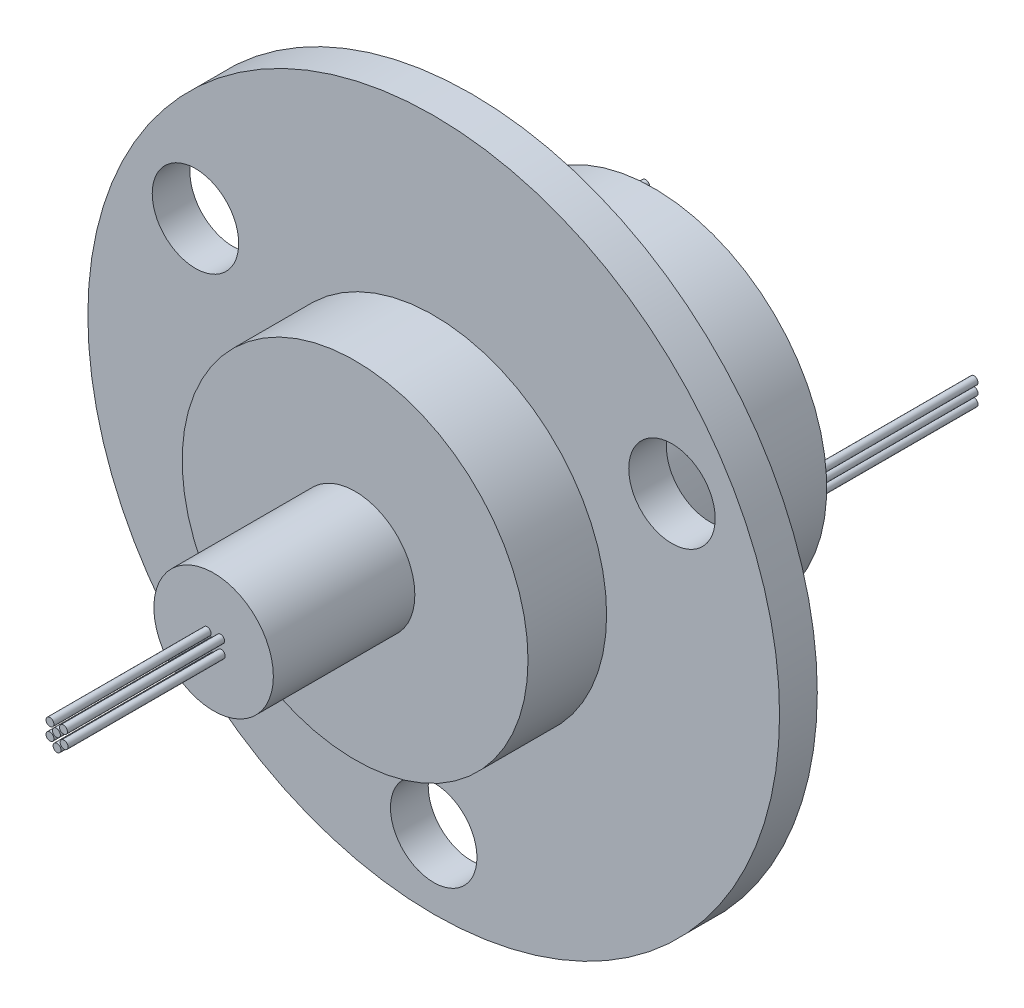
ISO-10303-21;
HEADER;
FILE_DESCRIPTION(('STEP AP214'),'2;1');
FILE_NAME('part.step','',(''),(''),'','','');
FILE_SCHEMA(('AUTOMOTIVE_DESIGN { 1 0 10303 214 1 1 1 1 }'));
ENDSEC;
DATA;
#1=APPLICATION_CONTEXT('core data for automotive mechanical design processes');
#2=APPLICATION_PROTOCOL_DEFINITION('international standard','automotive_design',2000,#1);
#3=PRODUCT_CONTEXT('',#1,'mechanical');
#4=PRODUCT('Part','Part','',(#3));
#5=PRODUCT_RELATED_PRODUCT_CATEGORY('part','',(#4));
#6=PRODUCT_DEFINITION_FORMATION('','',#4);
#7=PRODUCT_DEFINITION_CONTEXT('part definition',#1,'design');
#8=PRODUCT_DEFINITION('design','',#6,#7);
#9=PRODUCT_DEFINITION_SHAPE('','',#8);
#10=(LENGTH_UNIT() NAMED_UNIT(*) SI_UNIT(.MILLI.,.METRE.));
#11=(NAMED_UNIT(*) PLANE_ANGLE_UNIT() SI_UNIT($,.RADIAN.));
#12=(NAMED_UNIT(*) SI_UNIT($,.STERADIAN.) SOLID_ANGLE_UNIT());
#13=UNCERTAINTY_MEASURE_WITH_UNIT(LENGTH_MEASURE(1.E-05),#10,'distance_accuracy_value','');
#14=(GEOMETRIC_REPRESENTATION_CONTEXT(3) GLOBAL_UNCERTAINTY_ASSIGNED_CONTEXT((#13)) GLOBAL_UNIT_ASSIGNED_CONTEXT((#10,
#11,#12)) REPRESENTATION_CONTEXT('',''));
#15=CARTESIAN_POINT('',(0.,0.,0.));
#16=DIRECTION('',(0.,0.,1.));
#17=DIRECTION('',(1.,0.,0.));
#18=AXIS2_PLACEMENT_3D('',#15,#16,#17);
#19=CARTESIAN_POINT('',(0.,0.,0.));
#20=DIRECTION('',(0.,0.,-1.));
#21=DIRECTION('',(-1.,0.,0.));
#22=AXIS2_PLACEMENT_3D('',#19,#20,#21);
#23=PLANE('',#22);
#24=CARTESIAN_POINT('',(15.1554445662278,8.74999999999986,0.));
#25=DIRECTION('',(0.,0.,-1.));
#26=DIRECTION('',(-1.,0.,0.));
#27=AXIS2_PLACEMENT_3D('',#24,#25,#26);
#28=CIRCLE('',#27,2.74999999999998);
#29=CARTESIAN_POINT('',(12.4054445662278,8.74999999999986,0.));
#30=VERTEX_POINT('',#29);
#31=EDGE_CURVE('E66',#30,#30,#28,.T.);
#32=ORIENTED_EDGE('',*,*,#31,.F.);
#33=EDGE_LOOP('',(#32));
#34=FACE_BOUND('',#33,.T.);
#35=CARTESIAN_POINT('',(-15.1554445662276,8.75000000000007,0.));
#36=DIRECTION('',(0.,0.,-1.));
#37=DIRECTION('',(-1.,0.,0.));
#38=AXIS2_PLACEMENT_3D('',#35,#36,#37);
#39=CIRCLE('',#38,2.74999999999998);
#40=CARTESIAN_POINT('',(-17.9054445662276,8.75000000000007,0.));
#41=VERTEX_POINT('',#40);
#42=EDGE_CURVE('E56',#41,#41,#39,.T.);
#43=ORIENTED_EDGE('',*,*,#42,.F.);
#44=EDGE_LOOP('',(#43));
#45=FACE_BOUND('',#44,.T.);
#46=CARTESIAN_POINT('',(0.,-17.5,0.));
#47=DIRECTION('',(0.,0.,-1.));
#48=DIRECTION('',(-1.,0.,0.));
#49=AXIS2_PLACEMENT_3D('',#46,#47,#48);
#50=CIRCLE('',#49,2.74999999999998);
#51=CARTESIAN_POINT('',(-2.74999999999998,-17.5,0.));
#52=VERTEX_POINT('',#51);
#53=EDGE_CURVE('E53',#52,#52,#50,.T.);
#54=ORIENTED_EDGE('',*,*,#53,.F.);
#55=EDGE_LOOP('',(#54));
#56=FACE_BOUND('',#55,.T.);
#57=CARTESIAN_POINT('',(0.,0.,0.));
#58=DIRECTION('',(0.,0.,-1.));
#59=DIRECTION('',(-1.,0.,0.));
#60=AXIS2_PLACEMENT_3D('',#57,#58,#59);
#61=CIRCLE('',#60,22.);
#62=CARTESIAN_POINT('',(-22.,0.,0.));
#63=VERTEX_POINT('',#62);
#64=EDGE_CURVE('E123',#63,#63,#61,.T.);
#65=ORIENTED_EDGE('',*,*,#64,.T.);
#66=EDGE_LOOP('',(#65));
#67=FACE_BOUND('',#66,.T.);
#68=CARTESIAN_POINT('',(0.,0.,0.));
#69=DIRECTION('',(0.,0.,-1.));
#70=DIRECTION('',(-1.,0.,0.));
#71=AXIS2_PLACEMENT_3D('',#68,#69,#70);
#72=CIRCLE('',#71,11.);
#73=CARTESIAN_POINT('',(-11.,0.,0.));
#74=VERTEX_POINT('',#73);
#75=EDGE_CURVE('E101',#74,#74,#72,.T.);
#76=ORIENTED_EDGE('',*,*,#75,.F.);
#77=EDGE_LOOP('',(#76));
#78=FACE_BOUND('',#77,.T.);
#79=ADVANCED_FACE('F33',(#34,#45,#56,#67,#78),#23,.T.);
#80=CARTESIAN_POINT('',(0.,0.,16.4));
#81=DIRECTION('',(0.,0.,1.));
#82=DIRECTION('',(1.,0.,0.));
#83=AXIS2_PLACEMENT_3D('',#80,#81,#82);
#84=PLANE('',#83);
#85=CARTESIAN_POINT('',(-0.411746994245732,-0.416347148972295,16.4));
#86=DIRECTION('',(0.,0.,1.));
#87=DIRECTION('',(1.,0.,0.));
#88=AXIS2_PLACEMENT_3D('',#85,#86,#87);
#89=CIRCLE('',#88,0.25);
#90=CARTESIAN_POINT('',(-0.161746994245732,-0.416347148972295,16.4));
#91=VERTEX_POINT('',#90);
#92=EDGE_CURVE('E10',#91,#91,#89,.T.);
#93=ORIENTED_EDGE('',*,*,#92,.F.);
#94=EDGE_LOOP('',(#93));
#95=FACE_BOUND('',#94,.T.);
#96=CARTESIAN_POINT('',(0.447352368894371,0.400094571758075,16.4));
#97=DIRECTION('',(0.,0.,1.));
#98=DIRECTION('',(1.,0.,0.));
#99=AXIS2_PLACEMENT_3D('',#96,#97,#98);
#100=CIRCLE('',#99,0.25);
#101=CARTESIAN_POINT('',(0.697352368894371,0.400094571758075,16.4));
#102=VERTEX_POINT('',#101);
#103=EDGE_CURVE('E140',#102,#102,#100,.T.);
#104=ORIENTED_EDGE('',*,*,#103,.F.);
#105=EDGE_LOOP('',(#104));
#106=FACE_BOUND('',#105,.T.);
#107=CARTESIAN_POINT('',(-0.411746994245732,0.383652851027705,16.4));
#108=DIRECTION('',(0.,0.,1.));
#109=DIRECTION('',(1.,0.,0.));
#110=AXIS2_PLACEMENT_3D('',#107,#108,#109);
#111=CIRCLE('',#110,0.25);
#112=CARTESIAN_POINT('',(-0.161746994245732,0.383652851027705,16.4));
#113=VERTEX_POINT('',#112);
#114=EDGE_CURVE('E137',#113,#113,#111,.T.);
#115=ORIENTED_EDGE('',*,*,#114,.F.);
#116=EDGE_LOOP('',(#115));
#117=FACE_BOUND('',#116,.T.);
#118=CARTESIAN_POINT('',(0.488253005754268,-0.416347148972295,16.4));
#119=DIRECTION('',(0.,0.,1.));
#120=DIRECTION('',(1.,0.,0.));
#121=AXIS2_PLACEMENT_3D('',#118,#119,#120);
#122=CIRCLE('',#121,0.25);
#123=CARTESIAN_POINT('',(0.738253005754268,-0.416347148972295,16.4));
#124=VERTEX_POINT('',#123);
#125=EDGE_CURVE('E134',#124,#124,#122,.T.);
#126=ORIENTED_EDGE('',*,*,#125,.F.);
#127=EDGE_LOOP('',(#126));
#128=FACE_BOUND('',#127,.T.);
#129=CARTESIAN_POINT('',(0.0382530057542681,-0.816347148972295,16.4));
#130=DIRECTION('',(0.,0.,1.));
#131=DIRECTION('',(1.,0.,0.));
#132=AXIS2_PLACEMENT_3D('',#129,#130,#131);
#133=CIRCLE('',#132,0.25);
#134=CARTESIAN_POINT('',(0.288253005754268,-0.816347148972295,16.4));
#135=VERTEX_POINT('',#134);
#136=EDGE_CURVE('E131',#135,#135,#133,.T.);
#137=ORIENTED_EDGE('',*,*,#136,.F.);
#138=EDGE_LOOP('',(#137));
#139=FACE_BOUND('',#138,.T.);
#140=CARTESIAN_POINT('',(0.,0.,16.4));
#141=DIRECTION('',(0.,0.,1.));
#142=DIRECTION('',(1.,0.,0.));
#143=AXIS2_PLACEMENT_3D('',#140,#141,#142);
#144=CIRCLE('',#143,3.8);
#145=CARTESIAN_POINT('',(3.8,0.,16.4));
#146=VERTEX_POINT('',#145);
#147=EDGE_CURVE('E114',#146,#146,#144,.T.);
#148=ORIENTED_EDGE('',*,*,#147,.T.);
#149=EDGE_LOOP('',(#148));
#150=FACE_BOUND('',#149,.T.);
#151=CARTESIAN_POINT('',(0.,0.,16.4));
#152=DIRECTION('',(0.,0.,1.));
#153=DIRECTION('',(1.,0.,0.));
#154=AXIS2_PLACEMENT_3D('',#151,#152,#153);
#155=CIRCLE('',#154,0.25);
#156=CARTESIAN_POINT('',(0.25,0.,16.4));
#157=VERTEX_POINT('',#156);
#158=EDGE_CURVE('E105',#157,#157,#155,.T.);
#159=ORIENTED_EDGE('',*,*,#158,.F.);
#160=EDGE_LOOP('',(#159));
#161=FACE_BOUND('',#160,.T.);
#162=ADVANCED_FACE('F183',(#95,#106,#117,#128,#139,#150,#161),#84,.T.);
#163=CARTESIAN_POINT('',(0.,0.,7.4));
#164=DIRECTION('',(0.,0.,1.));
#165=DIRECTION('',(1.,0.,0.));
#166=AXIS2_PLACEMENT_3D('',#163,#164,#165);
#167=PLANE('',#166);
#168=CARTESIAN_POINT('',(0.,0.,7.4));
#169=DIRECTION('',(0.,0.,1.));
#170=DIRECTION('',(1.,0.,0.));
#171=AXIS2_PLACEMENT_3D('',#168,#169,#170);
#172=CIRCLE('',#171,11.);
#173=CARTESIAN_POINT('',(11.,0.,7.4));
#174=VERTEX_POINT('',#173);
#175=EDGE_CURVE('E120',#174,#174,#172,.T.);
#176=ORIENTED_EDGE('',*,*,#175,.T.);
#177=EDGE_LOOP('',(#176));
#178=FACE_BOUND('',#177,.T.);
#179=CARTESIAN_POINT('',(0.,0.,7.4));
#180=DIRECTION('',(0.,0.,1.));
#181=DIRECTION('',(1.,0.,0.));
#182=AXIS2_PLACEMENT_3D('',#179,#180,#181);
#183=CIRCLE('',#182,3.8);
#184=CARTESIAN_POINT('',(3.8,0.,7.4));
#185=VERTEX_POINT('',#184);
#186=EDGE_CURVE('E111',#185,#185,#183,.T.);
#187=ORIENTED_EDGE('',*,*,#186,.F.);
#188=EDGE_LOOP('',(#187));
#189=FACE_BOUND('',#188,.T.);
#190=ADVANCED_FACE('F189',(#178,#189),#167,.T.);
#191=CARTESIAN_POINT('',(22.,0.,2.4));
#192=DIRECTION('',(0.,0.,1.));
#193=DIRECTION('',(1.,0.,0.));
#194=AXIS2_PLACEMENT_3D('',#191,#192,#193);
#195=PLANE('',#194);
#196=CARTESIAN_POINT('',(15.1554445662278,8.74999999999986,2.4));
#197=DIRECTION('',(0.,0.,1.));
#198=DIRECTION('',(1.,0.,0.));
#199=AXIS2_PLACEMENT_3D('',#196,#197,#198);
#200=CIRCLE('',#199,2.74999999999998);
#201=CARTESIAN_POINT('',(17.9054445662277,8.74999999999986,2.4));
#202=VERTEX_POINT('',#201);
#203=EDGE_CURVE('E37',#202,#202,#200,.T.);
#204=ORIENTED_EDGE('',*,*,#203,.F.);
#205=EDGE_LOOP('',(#204));
#206=FACE_BOUND('',#205,.T.);
#207=CARTESIAN_POINT('',(-15.1554445662276,8.75000000000007,2.4));
#208=DIRECTION('',(0.,0.,1.));
#209=DIRECTION('',(1.,0.,0.));
#210=AXIS2_PLACEMENT_3D('',#207,#208,#209);
#211=CIRCLE('',#210,2.74999999999998);
#212=CARTESIAN_POINT('',(-12.4054445662277,8.75000000000007,2.4));
#213=VERTEX_POINT('',#212);
#214=EDGE_CURVE('E54',#213,#213,#211,.T.);
#215=ORIENTED_EDGE('',*,*,#214,.F.);
#216=EDGE_LOOP('',(#215));
#217=FACE_BOUND('',#216,.T.);
#218=CARTESIAN_POINT('',(0.,-17.5,2.4));
#219=DIRECTION('',(0.,0.,1.));
#220=DIRECTION('',(1.,0.,0.));
#221=AXIS2_PLACEMENT_3D('',#218,#219,#220);
#222=CIRCLE('',#221,2.74999999999998);
#223=CARTESIAN_POINT('',(2.74999999999998,-17.5,2.4));
#224=VERTEX_POINT('',#223);
#225=EDGE_CURVE('E50',#224,#224,#222,.T.);
#226=ORIENTED_EDGE('',*,*,#225,.F.);
#227=EDGE_LOOP('',(#226));
#228=FACE_BOUND('',#227,.T.);
#229=CARTESIAN_POINT('',(0.,0.,2.4));
#230=DIRECTION('',(0.,0.,-1.));
#231=DIRECTION('',(-1.,0.,0.));
#232=AXIS2_PLACEMENT_3D('',#229,#230,#231);
#233=CIRCLE('',#232,22.);
#234=CARTESIAN_POINT('',(-22.,0.,2.4));
#235=VERTEX_POINT('',#234);
#236=EDGE_CURVE('E128',#235,#235,#233,.T.);
#237=ORIENTED_EDGE('',*,*,#236,.F.);
#238=EDGE_LOOP('',(#237));
#239=FACE_BOUND('',#238,.T.);
#240=CARTESIAN_POINT('',(0.,0.,2.4));
#241=DIRECTION('',(0.,0.,1.));
#242=DIRECTION('',(1.,0.,0.));
#243=AXIS2_PLACEMENT_3D('',#240,#241,#242);
#244=CIRCLE('',#243,11.);
#245=CARTESIAN_POINT('',(11.,0.,2.4));
#246=VERTEX_POINT('',#245);
#247=EDGE_CURVE('E117',#246,#246,#244,.T.);
#248=ORIENTED_EDGE('',*,*,#247,.F.);
#249=EDGE_LOOP('',(#248));
#250=FACE_BOUND('',#249,.T.);
#251=ADVANCED_FACE('F197',(#206,#217,#228,#239,#250),#195,.T.);
#252=CARTESIAN_POINT('',(0.,0.,2.4));
#253=DIRECTION('',(0.,0.,-1.));
#254=DIRECTION('',(-1.,0.,0.));
#255=AXIS2_PLACEMENT_3D('',#252,#253,#254);
#256=CYLINDRICAL_SURFACE('',#255,22.);
#257=ORIENTED_EDGE('',*,*,#236,.T.);
#258=EDGE_LOOP('',(#257));
#259=FACE_BOUND('',#258,.T.);
#260=ORIENTED_EDGE('',*,*,#64,.F.);
#261=EDGE_LOOP('',(#260));
#262=FACE_BOUND('',#261,.T.);
#263=ADVANCED_FACE('F35',(#259,#262),#256,.T.);
#264=CARTESIAN_POINT('',(0.,0.,7.4));
#265=DIRECTION('',(0.,0.,-1.));
#266=DIRECTION('',(-1.,0.,0.));
#267=AXIS2_PLACEMENT_3D('',#264,#265,#266);
#268=CYLINDRICAL_SURFACE('',#267,11.);
#269=ORIENTED_EDGE('',*,*,#175,.F.);
#270=EDGE_LOOP('',(#269));
#271=FACE_BOUND('',#270,.T.);
#272=ORIENTED_EDGE('',*,*,#247,.T.);
#273=EDGE_LOOP('',(#272));
#274=FACE_BOUND('',#273,.T.);
#275=ADVANCED_FACE('F195',(#271,#274),#268,.T.);
#276=CARTESIAN_POINT('',(0.,0.,16.4));
#277=DIRECTION('',(0.,0.,-1.));
#278=DIRECTION('',(-1.,0.,0.));
#279=AXIS2_PLACEMENT_3D('',#276,#277,#278);
#280=CYLINDRICAL_SURFACE('',#279,3.8);
#281=ORIENTED_EDGE('',*,*,#147,.F.);
#282=EDGE_LOOP('',(#281));
#283=FACE_BOUND('',#282,.T.);
#284=ORIENTED_EDGE('',*,*,#186,.T.);
#285=EDGE_LOOP('',(#284));
#286=FACE_BOUND('',#285,.T.);
#287=ADVANCED_FACE('F216',(#283,#286),#280,.T.);
#288=CARTESIAN_POINT('',(0.,0.,26.4));
#289=DIRECTION('',(0.,0.,-1.));
#290=DIRECTION('',(-1.,0.,0.));
#291=AXIS2_PLACEMENT_3D('',#288,#289,#290);
#292=CYLINDRICAL_SURFACE('',#291,0.25);
#293=CARTESIAN_POINT('',(0.,0.,26.4));
#294=DIRECTION('',(0.,0.,1.));
#295=DIRECTION('',(1.,0.,0.));
#296=AXIS2_PLACEMENT_3D('',#293,#294,#295);
#297=CIRCLE('',#296,0.25);
#298=CARTESIAN_POINT('',(0.25,0.,26.4));
#299=VERTEX_POINT('',#298);
#300=EDGE_CURVE('E108',#299,#299,#297,.T.);
#301=ORIENTED_EDGE('',*,*,#300,.F.);
#302=EDGE_LOOP('',(#301));
#303=FACE_BOUND('',#302,.T.);
#304=ORIENTED_EDGE('',*,*,#158,.T.);
#305=EDGE_LOOP('',(#304));
#306=FACE_BOUND('',#305,.T.);
#307=ADVANCED_FACE('F221',(#303,#306),#292,.T.);
#308=CARTESIAN_POINT('',(0.,0.,26.4));
#309=DIRECTION('',(0.,0.,1.));
#310=DIRECTION('',(1.,0.,0.));
#311=AXIS2_PLACEMENT_3D('',#308,#309,#310);
#312=PLANE('',#311);
#313=ORIENTED_EDGE('',*,*,#300,.T.);
#314=EDGE_LOOP('',(#313));
#315=FACE_BOUND('',#314,.T.);
#316=ADVANCED_FACE('F178',(#315),#312,.T.);
#317=CARTESIAN_POINT('',(0.,0.,-11.6));
#318=DIRECTION('',(0.,0.,1.));
#319=DIRECTION('',(1.,0.,0.));
#320=AXIS2_PLACEMENT_3D('',#317,#318,#319);
#321=CYLINDRICAL_SURFACE('',#320,11.);
#322=CARTESIAN_POINT('',(0.,0.,-11.6));
#323=DIRECTION('',(0.,0.,-1.));
#324=DIRECTION('',(-1.,0.,0.));
#325=AXIS2_PLACEMENT_3D('',#322,#323,#324);
#326=CIRCLE('',#325,11.);
#327=CARTESIAN_POINT('',(-11.,0.,-11.6));
#328=VERTEX_POINT('',#327);
#329=EDGE_CURVE('E102',#328,#328,#326,.T.);
#330=ORIENTED_EDGE('',*,*,#329,.F.);
#331=EDGE_LOOP('',(#330));
#332=FACE_BOUND('',#331,.T.);
#333=ORIENTED_EDGE('',*,*,#75,.T.);
#334=EDGE_LOOP('',(#333));
#335=FACE_BOUND('',#334,.T.);
#336=ADVANCED_FACE('F163',(#332,#335),#321,.T.);
#337=CARTESIAN_POINT('',(0.,0.,-11.6));
#338=DIRECTION('',(0.,0.,-1.));
#339=DIRECTION('',(-1.,0.,0.));
#340=AXIS2_PLACEMENT_3D('',#337,#338,#339);
#341=PLANE('',#340);
#342=CARTESIAN_POINT('',(-10.5174332950639,0.968647222332921,-11.6));
#343=DIRECTION('',(0.,0.,-1.));
#344=DIRECTION('',(-1.,0.,0.));
#345=AXIS2_PLACEMENT_3D('',#342,#343,#344);
#346=CIRCLE('',#345,0.25);
#347=CARTESIAN_POINT('',(-10.7674332950639,0.968647222332921,-11.6));
#348=VERTEX_POINT('',#347);
#349=EDGE_CURVE('E41',#348,#348,#346,.T.);
#350=ORIENTED_EDGE('',*,*,#349,.F.);
#351=EDGE_LOOP('',(#350));
#352=FACE_BOUND('',#351,.T.);
#353=CARTESIAN_POINT('',(10.3716932147506,-0.6,-11.6));
#354=DIRECTION('',(0.,0.,-1.));
#355=DIRECTION('',(-1.,0.,0.));
#356=AXIS2_PLACEMENT_3D('',#353,#354,#355);
#357=CIRCLE('',#356,0.25);
#358=CARTESIAN_POINT('',(10.1216932147506,-0.6,-11.6));
#359=VERTEX_POINT('',#358);
#360=EDGE_CURVE('E46',#359,#359,#357,.T.);
#361=ORIENTED_EDGE('',*,*,#360,.F.);
#362=EDGE_LOOP('',(#361));
#363=FACE_BOUND('',#362,.T.);
#364=CARTESIAN_POINT('',(10.3716932147506,0.,-11.6));
#365=DIRECTION('',(0.,0.,-1.));
#366=DIRECTION('',(-1.,0.,0.));
#367=AXIS2_PLACEMENT_3D('',#364,#365,#366);
#368=CIRCLE('',#367,0.25);
#369=CARTESIAN_POINT('',(10.1216932147506,0.,-11.6));
#370=VERTEX_POINT('',#369);
#371=EDGE_CURVE('E152',#370,#370,#368,.T.);
#372=ORIENTED_EDGE('',*,*,#371,.F.);
#373=EDGE_LOOP('',(#372));
#374=FACE_BOUND('',#373,.T.);
#375=CARTESIAN_POINT('',(10.3716932147506,0.6,-11.6));
#376=DIRECTION('',(0.,0.,-1.));
#377=DIRECTION('',(-1.,0.,0.));
#378=AXIS2_PLACEMENT_3D('',#375,#376,#377);
#379=CIRCLE('',#378,0.25);
#380=CARTESIAN_POINT('',(10.1216932147506,0.6,-11.6));
#381=VERTEX_POINT('',#380);
#382=EDGE_CURVE('E149',#381,#381,#379,.T.);
#383=ORIENTED_EDGE('',*,*,#382,.F.);
#384=EDGE_LOOP('',(#383));
#385=FACE_BOUND('',#384,.T.);
#386=CARTESIAN_POINT('',(-10.5174332950639,0.377567123479139,-11.6));
#387=DIRECTION('',(0.,0.,-1.));
#388=DIRECTION('',(-1.,0.,0.));
#389=AXIS2_PLACEMENT_3D('',#386,#387,#388);
#390=CIRCLE('',#389,0.25);
#391=CARTESIAN_POINT('',(-10.7674332950639,0.377567123479139,-11.6));
#392=VERTEX_POINT('',#391);
#393=EDGE_CURVE('E146',#392,#392,#390,.T.);
#394=ORIENTED_EDGE('',*,*,#393,.F.);
#395=EDGE_LOOP('',(#394));
#396=FACE_BOUND('',#395,.T.);
#397=CARTESIAN_POINT('',(-10.5174332950639,-0.222432876520861,-11.6));
#398=DIRECTION('',(0.,0.,-1.));
#399=DIRECTION('',(-1.,0.,0.));
#400=AXIS2_PLACEMENT_3D('',#397,#398,#399);
#401=CIRCLE('',#400,0.25);
#402=CARTESIAN_POINT('',(-10.7674332950639,-0.222432876520861,-11.6));
#403=VERTEX_POINT('',#402);
#404=EDGE_CURVE('E143',#403,#403,#401,.T.);
#405=ORIENTED_EDGE('',*,*,#404,.F.);
#406=EDGE_LOOP('',(#405));
#407=FACE_BOUND('',#406,.T.);
#408=ORIENTED_EDGE('',*,*,#329,.T.);
#409=EDGE_LOOP('',(#408));
#410=FACE_BOUND('',#409,.T.);
#411=ADVANCED_FACE('F159',(#352,#363,#374,#385,#396,#407,#410),#341,.T.);
#412=CARTESIAN_POINT('',(0.0382530057542681,-0.816347148972295,26.4));
#413=DIRECTION('',(0.,0.,-1.));
#414=DIRECTION('',(-1.,0.,0.));
#415=AXIS2_PLACEMENT_3D('',#412,#413,#414);
#416=CYLINDRICAL_SURFACE('',#415,0.25);
#417=CARTESIAN_POINT('',(0.0382530057542681,-0.816347148972295,26.4));
#418=DIRECTION('',(0.,0.,-1.));
#419=DIRECTION('',(-1.,0.,0.));
#420=AXIS2_PLACEMENT_3D('',#417,#418,#419);
#421=CIRCLE('',#420,0.25);
#422=CARTESIAN_POINT('',(-0.211746994245732,-0.816347148972295,26.4));
#423=VERTEX_POINT('',#422);
#424=EDGE_CURVE('E98',#423,#423,#421,.T.);
#425=ORIENTED_EDGE('',*,*,#424,.T.);
#426=EDGE_LOOP('',(#425));
#427=FACE_BOUND('',#426,.T.);
#428=ORIENTED_EDGE('',*,*,#136,.T.);
#429=EDGE_LOOP('',(#428));
#430=FACE_BOUND('',#429,.T.);
#431=ADVANCED_FACE('F162',(#427,#430),#416,.T.);
#432=CARTESIAN_POINT('',(0.288253005754268,-0.816347148972295,26.4));
#433=DIRECTION('',(0.,0.,1.));
#434=DIRECTION('',(1.,0.,0.));
#435=AXIS2_PLACEMENT_3D('',#432,#433,#434);
#436=PLANE('',#435);
#437=ORIENTED_EDGE('',*,*,#424,.F.);
#438=EDGE_LOOP('',(#437));
#439=FACE_BOUND('',#438,.T.);
#440=ADVANCED_FACE('F240',(#439),#436,.T.);
#441=CARTESIAN_POINT('',(0.488253005754268,-0.416347148972295,26.4));
#442=DIRECTION('',(0.,0.,-1.));
#443=DIRECTION('',(-1.,0.,0.));
#444=AXIS2_PLACEMENT_3D('',#441,#442,#443);
#445=CYLINDRICAL_SURFACE('',#444,0.25);
#446=CARTESIAN_POINT('',(0.488253005754268,-0.416347148972295,26.4));
#447=DIRECTION('',(0.,0.,-1.));
#448=DIRECTION('',(-1.,0.,0.));
#449=AXIS2_PLACEMENT_3D('',#446,#447,#448);
#450=CIRCLE('',#449,0.25);
#451=CARTESIAN_POINT('',(0.238253005754268,-0.416347148972295,26.4));
#452=VERTEX_POINT('',#451);
#453=EDGE_CURVE('E95',#452,#452,#450,.T.);
#454=ORIENTED_EDGE('',*,*,#453,.T.);
#455=EDGE_LOOP('',(#454));
#456=FACE_BOUND('',#455,.T.);
#457=ORIENTED_EDGE('',*,*,#125,.T.);
#458=EDGE_LOOP('',(#457));
#459=FACE_BOUND('',#458,.T.);
#460=ADVANCED_FACE('F244',(#456,#459),#445,.T.);
#461=CARTESIAN_POINT('',(0.738253005754268,-0.416347148972295,26.4));
#462=DIRECTION('',(0.,0.,1.));
#463=DIRECTION('',(1.,0.,0.));
#464=AXIS2_PLACEMENT_3D('',#461,#462,#463);
#465=PLANE('',#464);
#466=ORIENTED_EDGE('',*,*,#453,.F.);
#467=EDGE_LOOP('',(#466));
#468=FACE_BOUND('',#467,.T.);
#469=ADVANCED_FACE('F248',(#468),#465,.T.);
#470=CARTESIAN_POINT('',(-0.411746994245732,0.383652851027705,26.4));
#471=DIRECTION('',(0.,0.,-1.));
#472=DIRECTION('',(-1.,0.,0.));
#473=AXIS2_PLACEMENT_3D('',#470,#471,#472);
#474=CYLINDRICAL_SURFACE('',#473,0.25);
#475=CARTESIAN_POINT('',(-0.411746994245732,0.383652851027705,26.4));
#476=DIRECTION('',(0.,0.,-1.));
#477=DIRECTION('',(-1.,0.,0.));
#478=AXIS2_PLACEMENT_3D('',#475,#476,#477);
#479=CIRCLE('',#478,0.25);
#480=CARTESIAN_POINT('',(-0.661746994245732,0.383652851027705,26.4));
#481=VERTEX_POINT('',#480);
#482=EDGE_CURVE('E92',#481,#481,#479,.T.);
#483=ORIENTED_EDGE('',*,*,#482,.T.);
#484=EDGE_LOOP('',(#483));
#485=FACE_BOUND('',#484,.T.);
#486=ORIENTED_EDGE('',*,*,#114,.T.);
#487=EDGE_LOOP('',(#486));
#488=FACE_BOUND('',#487,.T.);
#489=ADVANCED_FACE('F252',(#485,#488),#474,.T.);
#490=CARTESIAN_POINT('',(-0.161746994245732,0.383652851027705,26.4));
#491=DIRECTION('',(0.,0.,1.));
#492=DIRECTION('',(1.,0.,0.));
#493=AXIS2_PLACEMENT_3D('',#490,#491,#492);
#494=PLANE('',#493);
#495=ORIENTED_EDGE('',*,*,#482,.F.);
#496=EDGE_LOOP('',(#495));
#497=FACE_BOUND('',#496,.T.);
#498=ADVANCED_FACE('F256',(#497),#494,.T.);
#499=CARTESIAN_POINT('',(0.447352368894371,0.400094571758075,26.4));
#500=DIRECTION('',(0.,0.,-1.));
#501=DIRECTION('',(-1.,0.,0.));
#502=AXIS2_PLACEMENT_3D('',#499,#500,#501);
#503=CYLINDRICAL_SURFACE('',#502,0.25);
#504=CARTESIAN_POINT('',(0.447352368894371,0.400094571758075,26.4));
#505=DIRECTION('',(0.,0.,-1.));
#506=DIRECTION('',(-1.,0.,0.));
#507=AXIS2_PLACEMENT_3D('',#504,#505,#506);
#508=CIRCLE('',#507,0.25);
#509=CARTESIAN_POINT('',(0.197352368894371,0.400094571758075,26.4));
#510=VERTEX_POINT('',#509);
#511=EDGE_CURVE('E89',#510,#510,#508,.T.);
#512=ORIENTED_EDGE('',*,*,#511,.T.);
#513=EDGE_LOOP('',(#512));
#514=FACE_BOUND('',#513,.T.);
#515=ORIENTED_EDGE('',*,*,#103,.T.);
#516=EDGE_LOOP('',(#515));
#517=FACE_BOUND('',#516,.T.);
#518=ADVANCED_FACE('F260',(#514,#517),#503,.T.);
#519=CARTESIAN_POINT('',(0.697352368894371,0.400094571758075,26.4));
#520=DIRECTION('',(0.,0.,1.));
#521=DIRECTION('',(1.,0.,0.));
#522=AXIS2_PLACEMENT_3D('',#519,#520,#521);
#523=PLANE('',#522);
#524=ORIENTED_EDGE('',*,*,#511,.F.);
#525=EDGE_LOOP('',(#524));
#526=FACE_BOUND('',#525,.T.);
#527=ADVANCED_FACE('F264',(#526),#523,.T.);
#528=CARTESIAN_POINT('',(-10.5174332950639,-0.222432876520861,-21.6));
#529=DIRECTION('',(0.,0.,1.));
#530=DIRECTION('',(1.,0.,0.));
#531=AXIS2_PLACEMENT_3D('',#528,#529,#530);
#532=CYLINDRICAL_SURFACE('',#531,0.25);
#533=CARTESIAN_POINT('',(-10.5174332950639,-0.222432876520861,-21.6));
#534=DIRECTION('',(0.,0.,1.));
#535=DIRECTION('',(1.,0.,0.));
#536=AXIS2_PLACEMENT_3D('',#533,#534,#535);
#537=CIRCLE('',#536,0.25);
#538=CARTESIAN_POINT('',(-10.2674332950639,-0.222432876520861,-21.6));
#539=VERTEX_POINT('',#538);
#540=EDGE_CURVE('E86',#539,#539,#537,.T.);
#541=ORIENTED_EDGE('',*,*,#540,.T.);
#542=EDGE_LOOP('',(#541));
#543=FACE_BOUND('',#542,.T.);
#544=ORIENTED_EDGE('',*,*,#404,.T.);
#545=EDGE_LOOP('',(#544));
#546=FACE_BOUND('',#545,.T.);
#547=ADVANCED_FACE('F268',(#543,#546),#532,.T.);
#548=CARTESIAN_POINT('',(-10.2674332950639,-0.222432876520861,-21.6));
#549=DIRECTION('',(0.,0.,-1.));
#550=DIRECTION('',(-1.,0.,0.));
#551=AXIS2_PLACEMENT_3D('',#548,#549,#550);
#552=PLANE('',#551);
#553=ORIENTED_EDGE('',*,*,#540,.F.);
#554=EDGE_LOOP('',(#553));
#555=FACE_BOUND('',#554,.T.);
#556=ADVANCED_FACE('F272',(#555),#552,.T.);
#557=CARTESIAN_POINT('',(-10.5174332950639,0.377567123479139,-21.6));
#558=DIRECTION('',(0.,0.,1.));
#559=DIRECTION('',(1.,0.,0.));
#560=AXIS2_PLACEMENT_3D('',#557,#558,#559);
#561=CYLINDRICAL_SURFACE('',#560,0.25);
#562=CARTESIAN_POINT('',(-10.5174332950639,0.377567123479139,-21.6));
#563=DIRECTION('',(0.,0.,1.));
#564=DIRECTION('',(1.,0.,0.));
#565=AXIS2_PLACEMENT_3D('',#562,#563,#564);
#566=CIRCLE('',#565,0.25);
#567=CARTESIAN_POINT('',(-10.2674332950639,0.377567123479139,-21.6));
#568=VERTEX_POINT('',#567);
#569=EDGE_CURVE('E83',#568,#568,#566,.T.);
#570=ORIENTED_EDGE('',*,*,#569,.T.);
#571=EDGE_LOOP('',(#570));
#572=FACE_BOUND('',#571,.T.);
#573=ORIENTED_EDGE('',*,*,#393,.T.);
#574=EDGE_LOOP('',(#573));
#575=FACE_BOUND('',#574,.T.);
#576=ADVANCED_FACE('F276',(#572,#575),#561,.T.);
#577=CARTESIAN_POINT('',(-10.2674332950639,0.377567123479139,-21.6));
#578=DIRECTION('',(0.,0.,-1.));
#579=DIRECTION('',(-1.,0.,0.));
#580=AXIS2_PLACEMENT_3D('',#577,#578,#579);
#581=PLANE('',#580);
#582=ORIENTED_EDGE('',*,*,#569,.F.);
#583=EDGE_LOOP('',(#582));
#584=FACE_BOUND('',#583,.T.);
#585=ADVANCED_FACE('F280',(#584),#581,.T.);
#586=CARTESIAN_POINT('',(10.3716932147506,0.6,-21.6));
#587=DIRECTION('',(0.,0.,1.));
#588=DIRECTION('',(1.,0.,0.));
#589=AXIS2_PLACEMENT_3D('',#586,#587,#588);
#590=CYLINDRICAL_SURFACE('',#589,0.25);
#591=CARTESIAN_POINT('',(10.3716932147506,0.6,-21.6));
#592=DIRECTION('',(0.,0.,1.));
#593=DIRECTION('',(1.,0.,0.));
#594=AXIS2_PLACEMENT_3D('',#591,#592,#593);
#595=CIRCLE('',#594,0.25);
#596=CARTESIAN_POINT('',(10.6216932147506,0.6,-21.6));
#597=VERTEX_POINT('',#596);
#598=EDGE_CURVE('E80',#597,#597,#595,.T.);
#599=ORIENTED_EDGE('',*,*,#598,.T.);
#600=EDGE_LOOP('',(#599));
#601=FACE_BOUND('',#600,.T.);
#602=ORIENTED_EDGE('',*,*,#382,.T.);
#603=EDGE_LOOP('',(#602));
#604=FACE_BOUND('',#603,.T.);
#605=ADVANCED_FACE('F284',(#601,#604),#590,.T.);
#606=CARTESIAN_POINT('',(10.6216932147506,0.6,-21.6));
#607=DIRECTION('',(0.,0.,-1.));
#608=DIRECTION('',(-1.,0.,0.));
#609=AXIS2_PLACEMENT_3D('',#606,#607,#608);
#610=PLANE('',#609);
#611=ORIENTED_EDGE('',*,*,#598,.F.);
#612=EDGE_LOOP('',(#611));
#613=FACE_BOUND('',#612,.T.);
#614=ADVANCED_FACE('F288',(#613),#610,.T.);
#615=CARTESIAN_POINT('',(10.3716932147506,0.,-21.6));
#616=DIRECTION('',(0.,0.,1.));
#617=DIRECTION('',(1.,0.,0.));
#618=AXIS2_PLACEMENT_3D('',#615,#616,#617);
#619=CYLINDRICAL_SURFACE('',#618,0.25);
#620=CARTESIAN_POINT('',(10.3716932147506,0.,-21.6));
#621=DIRECTION('',(0.,0.,1.));
#622=DIRECTION('',(1.,0.,0.));
#623=AXIS2_PLACEMENT_3D('',#620,#621,#622);
#624=CIRCLE('',#623,0.25);
#625=CARTESIAN_POINT('',(10.6216932147506,0.,-21.6));
#626=VERTEX_POINT('',#625);
#627=EDGE_CURVE('E77',#626,#626,#624,.T.);
#628=ORIENTED_EDGE('',*,*,#627,.T.);
#629=EDGE_LOOP('',(#628));
#630=FACE_BOUND('',#629,.T.);
#631=ORIENTED_EDGE('',*,*,#371,.T.);
#632=EDGE_LOOP('',(#631));
#633=FACE_BOUND('',#632,.T.);
#634=ADVANCED_FACE('F292',(#630,#633),#619,.T.);
#635=CARTESIAN_POINT('',(10.6216932147506,0.,-21.6));
#636=DIRECTION('',(0.,0.,-1.));
#637=DIRECTION('',(-1.,0.,0.));
#638=AXIS2_PLACEMENT_3D('',#635,#636,#637);
#639=PLANE('',#638);
#640=ORIENTED_EDGE('',*,*,#627,.F.);
#641=EDGE_LOOP('',(#640));
#642=FACE_BOUND('',#641,.T.);
#643=ADVANCED_FACE('F296',(#642),#639,.T.);
#644=CARTESIAN_POINT('',(10.3716932147506,-0.6,-21.6));
#645=DIRECTION('',(0.,0.,1.));
#646=DIRECTION('',(1.,0.,0.));
#647=AXIS2_PLACEMENT_3D('',#644,#645,#646);
#648=CYLINDRICAL_SURFACE('',#647,0.25);
#649=CARTESIAN_POINT('',(10.3716932147506,-0.6,-21.6));
#650=DIRECTION('',(0.,0.,1.));
#651=DIRECTION('',(1.,0.,0.));
#652=AXIS2_PLACEMENT_3D('',#649,#650,#651);
#653=CIRCLE('',#652,0.25);
#654=CARTESIAN_POINT('',(10.6216932147506,-0.6,-21.6));
#655=VERTEX_POINT('',#654);
#656=EDGE_CURVE('E74',#655,#655,#653,.T.);
#657=ORIENTED_EDGE('',*,*,#656,.T.);
#658=EDGE_LOOP('',(#657));
#659=FACE_BOUND('',#658,.T.);
#660=ORIENTED_EDGE('',*,*,#360,.T.);
#661=EDGE_LOOP('',(#660));
#662=FACE_BOUND('',#661,.T.);
#663=ADVANCED_FACE('F157',(#659,#662),#648,.T.);
#664=CARTESIAN_POINT('',(10.6216932147506,-0.6,-21.6));
#665=DIRECTION('',(0.,0.,-1.));
#666=DIRECTION('',(-1.,0.,0.));
#667=AXIS2_PLACEMENT_3D('',#664,#665,#666);
#668=PLANE('',#667);
#669=ORIENTED_EDGE('',*,*,#656,.F.);
#670=EDGE_LOOP('',(#669));
#671=FACE_BOUND('',#670,.T.);
#672=ADVANCED_FACE('F303',(#671),#668,.T.);
#673=CARTESIAN_POINT('',(-10.5174332950639,0.968647222332921,-21.6));
#674=DIRECTION('',(0.,0.,1.));
#675=DIRECTION('',(1.,0.,0.));
#676=AXIS2_PLACEMENT_3D('',#673,#674,#675);
#677=CYLINDRICAL_SURFACE('',#676,0.25);
#678=CARTESIAN_POINT('',(-10.5174332950639,0.968647222332921,-21.6));
#679=DIRECTION('',(0.,0.,1.));
#680=DIRECTION('',(1.,0.,0.));
#681=AXIS2_PLACEMENT_3D('',#678,#679,#680);
#682=CIRCLE('',#681,0.25);
#683=CARTESIAN_POINT('',(-10.2674332950639,0.968647222332921,-21.6));
#684=VERTEX_POINT('',#683);
#685=EDGE_CURVE('E71',#684,#684,#682,.T.);
#686=ORIENTED_EDGE('',*,*,#685,.T.);
#687=EDGE_LOOP('',(#686));
#688=FACE_BOUND('',#687,.T.);
#689=ORIENTED_EDGE('',*,*,#349,.T.);
#690=EDGE_LOOP('',(#689));
#691=FACE_BOUND('',#690,.T.);
#692=ADVANCED_FACE('F307',(#688,#691),#677,.T.);
#693=CARTESIAN_POINT('',(-10.2674332950639,0.968647222332921,-21.6));
#694=DIRECTION('',(0.,0.,-1.));
#695=DIRECTION('',(-1.,0.,0.));
#696=AXIS2_PLACEMENT_3D('',#693,#694,#695);
#697=PLANE('',#696);
#698=ORIENTED_EDGE('',*,*,#685,.F.);
#699=EDGE_LOOP('',(#698));
#700=FACE_BOUND('',#699,.T.);
#701=ADVANCED_FACE('F311',(#700),#697,.T.);
#702=CARTESIAN_POINT('',(-0.411746994245732,-0.416347148972295,26.4));
#703=DIRECTION('',(0.,0.,-1.));
#704=DIRECTION('',(-1.,0.,0.));
#705=AXIS2_PLACEMENT_3D('',#702,#703,#704);
#706=CYLINDRICAL_SURFACE('',#705,0.25);
#707=CARTESIAN_POINT('',(-0.411746994245732,-0.416347148972295,26.4));
#708=DIRECTION('',(0.,0.,-1.));
#709=DIRECTION('',(-1.,0.,0.));
#710=AXIS2_PLACEMENT_3D('',#707,#708,#709);
#711=CIRCLE('',#710,0.25);
#712=CARTESIAN_POINT('',(-0.661746994245732,-0.416347148972295,26.4));
#713=VERTEX_POINT('',#712);
#714=EDGE_CURVE('E52',#713,#713,#711,.T.);
#715=ORIENTED_EDGE('',*,*,#714,.T.);
#716=EDGE_LOOP('',(#715));
#717=FACE_BOUND('',#716,.T.);
#718=ORIENTED_EDGE('',*,*,#92,.T.);
#719=EDGE_LOOP('',(#718));
#720=FACE_BOUND('',#719,.T.);
#721=ADVANCED_FACE('F315',(#717,#720),#706,.T.);
#722=CARTESIAN_POINT('',(-0.161746994245732,-0.416347148972295,26.4));
#723=DIRECTION('',(0.,0.,1.));
#724=DIRECTION('',(1.,0.,0.));
#725=AXIS2_PLACEMENT_3D('',#722,#723,#724);
#726=PLANE('',#725);
#727=ORIENTED_EDGE('',*,*,#714,.F.);
#728=EDGE_LOOP('',(#727));
#729=FACE_BOUND('',#728,.T.);
#730=ADVANCED_FACE('F319',(#729),#726,.T.);
#731=CARTESIAN_POINT('',(0.,-17.5,0.));
#732=DIRECTION('',(0.,0.,-1.));
#733=DIRECTION('',(-1.,0.,0.));
#734=AXIS2_PLACEMENT_3D('',#731,#732,#733);
#735=CYLINDRICAL_SURFACE('',#734,2.74999999999998);
#736=ORIENTED_EDGE('',*,*,#225,.T.);
#737=EDGE_LOOP('',(#736));
#738=FACE_BOUND('',#737,.T.);
#739=ORIENTED_EDGE('',*,*,#53,.T.);
#740=EDGE_LOOP('',(#739));
#741=FACE_BOUND('',#740,.T.);
#742=ADVANCED_FACE('F323',(#738,#741),#735,.F.);
#743=CARTESIAN_POINT('',(-15.1554445662276,8.75000000000007,0.));
#744=DIRECTION('',(0.,0.,-1.));
#745=DIRECTION('',(-1.,0.,0.));
#746=AXIS2_PLACEMENT_3D('',#743,#744,#745);
#747=CYLINDRICAL_SURFACE('',#746,2.74999999999998);
#748=ORIENTED_EDGE('',*,*,#214,.T.);
#749=EDGE_LOOP('',(#748));
#750=FACE_BOUND('',#749,.T.);
#751=ORIENTED_EDGE('',*,*,#42,.T.);
#752=EDGE_LOOP('',(#751));
#753=FACE_BOUND('',#752,.T.);
#754=ADVANCED_FACE('F327',(#750,#753),#747,.F.);
#755=CARTESIAN_POINT('',(15.1554445662278,8.74999999999986,0.));
#756=DIRECTION('',(0.,0.,-1.));
#757=DIRECTION('',(-1.,0.,0.));
#758=AXIS2_PLACEMENT_3D('',#755,#756,#757);
#759=CYLINDRICAL_SURFACE('',#758,2.74999999999998);
#760=ORIENTED_EDGE('',*,*,#203,.T.);
#761=EDGE_LOOP('',(#760));
#762=FACE_BOUND('',#761,.T.);
#763=ORIENTED_EDGE('',*,*,#31,.T.);
#764=EDGE_LOOP('',(#763));
#765=FACE_BOUND('',#764,.T.);
#766=ADVANCED_FACE('F331',(#762,#765),#759,.F.);
#767=CLOSED_SHELL('',(#79,#162,#190,#251,#263,#275,#287,#307,#316,#336,#411,#431,#440,#460,#469,
#489,#498,#518,#527,#547,#556,#576,#585,#605,#614,#634,#643,#663,#672,#692,#701,#721,#730,#742,
#754,#766));
#768=MANIFOLD_SOLID_BREP('B2',#767);
#769=ADVANCED_BREP_SHAPE_REPRESENTATION('',(#18,#768),#14);
#770=SHAPE_DEFINITION_REPRESENTATION(#9,#769);
ENDSEC;
END-ISO-10303-21;
